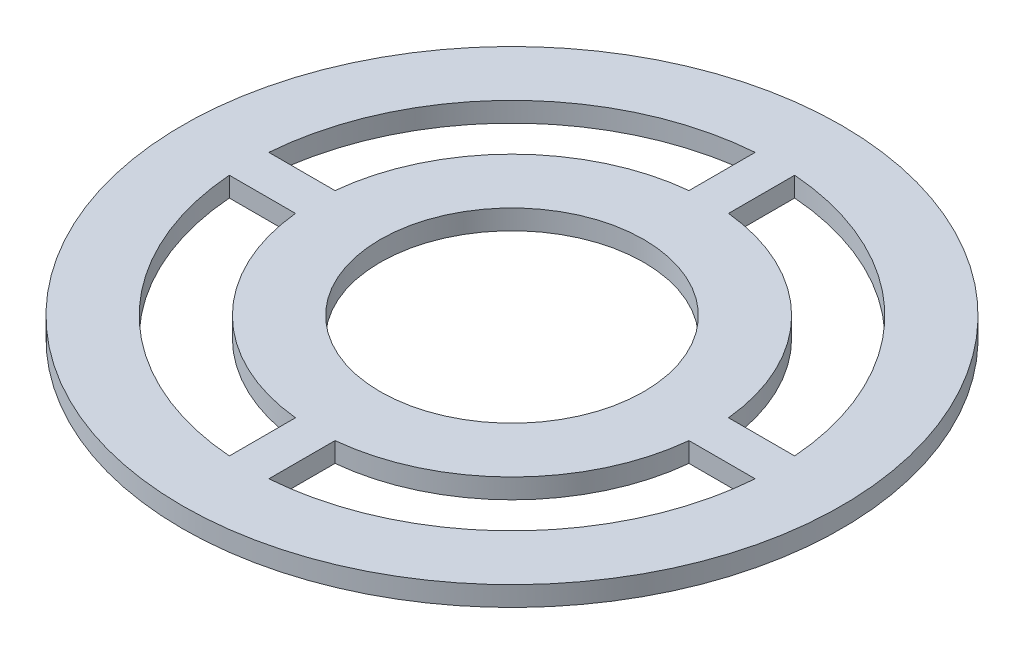
ISO-10303-21;
HEADER;
FILE_DESCRIPTION(('STEP AP214'),'2;1');
FILE_NAME('part.step','',(''),(''),'','','');
FILE_SCHEMA(('AUTOMOTIVE_DESIGN { 1 0 10303 214 1 1 1 1 }'));
ENDSEC;
DATA;
#1=APPLICATION_CONTEXT('core data for automotive mechanical design processes');
#2=APPLICATION_PROTOCOL_DEFINITION('international standard','automotive_design',2000,#1);
#3=PRODUCT_CONTEXT('',#1,'mechanical');
#4=PRODUCT('Part','Part','',(#3));
#5=PRODUCT_RELATED_PRODUCT_CATEGORY('part','',(#4));
#6=PRODUCT_DEFINITION_FORMATION('','',#4);
#7=PRODUCT_DEFINITION_CONTEXT('part definition',#1,'design');
#8=PRODUCT_DEFINITION('design','',#6,#7);
#9=PRODUCT_DEFINITION_SHAPE('','',#8);
#10=(LENGTH_UNIT() NAMED_UNIT(*) SI_UNIT(.MILLI.,.METRE.));
#11=(NAMED_UNIT(*) PLANE_ANGLE_UNIT() SI_UNIT($,.RADIAN.));
#12=(NAMED_UNIT(*) SI_UNIT($,.STERADIAN.) SOLID_ANGLE_UNIT());
#13=UNCERTAINTY_MEASURE_WITH_UNIT(LENGTH_MEASURE(1.E-05),#10,'distance_accuracy_value','');
#14=(GEOMETRIC_REPRESENTATION_CONTEXT(3) GLOBAL_UNCERTAINTY_ASSIGNED_CONTEXT((#13)) GLOBAL_UNIT_ASSIGNED_CONTEXT((#10,
#11,#12)) REPRESENTATION_CONTEXT('',''));
#15=CARTESIAN_POINT('',(0.,0.,0.));
#16=DIRECTION('',(0.,0.,1.));
#17=DIRECTION('',(1.,0.,0.));
#18=AXIS2_PLACEMENT_3D('',#15,#16,#17);
#19=CARTESIAN_POINT('',(0.,1.5,0.));
#20=DIRECTION('',(0.,-1.,0.));
#21=DIRECTION('',(0.,0.,-1.));
#22=AXIS2_PLACEMENT_3D('',#19,#20,#21);
#23=CYLINDRICAL_SURFACE('',#22,20.);
#24=DIRECTION('',(0.,-1.,0.));
#25=VECTOR('',#24,1.);
#26=CARTESIAN_POINT('',(-1.5,1.5,19.9436706751791));
#27=LINE('',#26,#25);
#28=CARTESIAN_POINT('',(-1.5,0.,19.9436706751791));
#29=VERTEX_POINT('',#28);
#30=CARTESIAN_POINT('',(-1.5,1.5,19.9436706751791));
#31=VERTEX_POINT('',#30);
#32=EDGE_CURVE('E158',#29,#31,#27,.F.);
#33=ORIENTED_EDGE('',*,*,#32,.F.);
#34=CARTESIAN_POINT('',(0.,0.,0.));
#35=DIRECTION('',(0.,1.,0.));
#36=DIRECTION('',(0.,0.,1.));
#37=AXIS2_PLACEMENT_3D('',#34,#35,#36);
#38=CIRCLE('',#37,20.);
#39=CARTESIAN_POINT('',(-19.9436706751791,0.,1.5));
#40=VERTEX_POINT('',#39);
#41=EDGE_CURVE('E241',#40,#29,#38,.T.);
#42=ORIENTED_EDGE('',*,*,#41,.F.);
#43=DIRECTION('',(0.,-1.,0.));
#44=VECTOR('',#43,1.);
#45=CARTESIAN_POINT('',(-19.9436706751791,1.5,1.5));
#46=LINE('',#45,#44);
#47=CARTESIAN_POINT('',(-19.9436706751791,1.5,1.5));
#48=VERTEX_POINT('',#47);
#49=EDGE_CURVE('E258',#48,#40,#46,.T.);
#50=ORIENTED_EDGE('',*,*,#49,.F.);
#51=CARTESIAN_POINT('',(0.,1.5,0.));
#52=DIRECTION('',(0.,1.,0.));
#53=DIRECTION('',(0.,0.,1.));
#54=AXIS2_PLACEMENT_3D('',#51,#52,#53);
#55=CIRCLE('',#54,20.);
#56=EDGE_CURVE('E56',#48,#31,#55,.T.);
#57=ORIENTED_EDGE('',*,*,#56,.T.);
#58=EDGE_LOOP('',(#33,#42,#50,#57));
#59=FACE_BOUND('',#58,.T.);
#60=ADVANCED_FACE('F41',(#59),#23,.F.);
#61=CARTESIAN_POINT('',(0.,1.5,0.));
#62=DIRECTION('',(0.,-1.,0.));
#63=DIRECTION('',(0.,0.,-1.));
#64=AXIS2_PLACEMENT_3D('',#61,#62,#63);
#65=CYLINDRICAL_SURFACE('',#64,15.);
#66=CARTESIAN_POINT('',(0.,0.,0.));
#67=DIRECTION('',(0.,1.,0.));
#68=DIRECTION('',(0.,0.,1.));
#69=AXIS2_PLACEMENT_3D('',#66,#67,#68);
#70=CIRCLE('',#69,15.);
#71=CARTESIAN_POINT('',(-14.9248115565993,0.,1.5));
#72=VERTEX_POINT('',#71);
#73=CARTESIAN_POINT('',(-1.5,0.,14.9248115565993));
#74=VERTEX_POINT('',#73);
#75=EDGE_CURVE('E169',#72,#74,#70,.T.);
#76=ORIENTED_EDGE('',*,*,#75,.T.);
#77=DIRECTION('',(0.,-1.,0.));
#78=VECTOR('',#77,1.);
#79=CARTESIAN_POINT('',(-1.5,1.5,14.9248115565993));
#80=LINE('',#79,#78);
#81=CARTESIAN_POINT('',(-1.5,1.5,14.9248115565993));
#82=VERTEX_POINT('',#81);
#83=EDGE_CURVE('E12',#74,#82,#80,.F.);
#84=ORIENTED_EDGE('',*,*,#83,.T.);
#85=CARTESIAN_POINT('',(0.,1.5,0.));
#86=DIRECTION('',(0.,1.,0.));
#87=DIRECTION('',(0.,0.,1.));
#88=AXIS2_PLACEMENT_3D('',#85,#86,#87);
#89=CIRCLE('',#88,15.);
#90=CARTESIAN_POINT('',(-14.9248115565993,1.5,1.5));
#91=VERTEX_POINT('',#90);
#92=EDGE_CURVE('E166',#91,#82,#89,.T.);
#93=ORIENTED_EDGE('',*,*,#92,.F.);
#94=DIRECTION('',(0.,1.,0.));
#95=VECTOR('',#94,1.);
#96=CARTESIAN_POINT('',(-14.9248115565993,0.,1.5));
#97=LINE('',#96,#95);
#98=EDGE_CURVE('E303',#72,#91,#97,.T.);
#99=ORIENTED_EDGE('',*,*,#98,.F.);
#100=EDGE_LOOP('',(#76,#84,#93,#99));
#101=FACE_BOUND('',#100,.T.);
#102=ADVANCED_FACE('F165',(#101),#65,.T.);
#103=DIRECTION('',(0.,-1.,0.));
#104=VECTOR('',#103,1.);
#105=CARTESIAN_POINT('',(19.9436706751791,1.5,-1.5));
#106=LINE('',#105,#104);
#107=CARTESIAN_POINT('',(19.9436706751791,1.5,-1.5));
#108=VERTEX_POINT('',#107);
#109=CARTESIAN_POINT('',(19.9436706751791,0.,-1.5));
#110=VERTEX_POINT('',#109);
#111=EDGE_CURVE('E209',#108,#110,#106,.T.);
#112=ORIENTED_EDGE('',*,*,#111,.F.);
#113=CARTESIAN_POINT('',(1.5,1.5,-19.9436706751791));
#114=VERTEX_POINT('',#113);
#115=EDGE_CURVE('E338',#108,#114,#55,.T.);
#116=ORIENTED_EDGE('',*,*,#115,.T.);
#117=DIRECTION('',(0.,-1.,0.));
#118=VECTOR('',#117,1.);
#119=CARTESIAN_POINT('',(1.5,1.5,-19.9436706751791));
#120=LINE('',#119,#118);
#121=CARTESIAN_POINT('',(1.5,0.,-19.9436706751791));
#122=VERTEX_POINT('',#121);
#123=EDGE_CURVE('E199',#122,#114,#120,.F.);
#124=ORIENTED_EDGE('',*,*,#123,.F.);
#125=EDGE_CURVE('E250',#110,#122,#38,.T.);
#126=ORIENTED_EDGE('',*,*,#125,.F.);
#127=EDGE_LOOP('',(#112,#116,#124,#126));
#128=FACE_BOUND('',#127,.T.);
#129=ADVANCED_FACE('F309',(#128),#23,.F.);
#130=CARTESIAN_POINT('',(14.9248115565993,1.5,-1.5));
#131=VERTEX_POINT('',#130);
#132=CARTESIAN_POINT('',(1.5,1.5,-14.9248115565993));
#133=VERTEX_POINT('',#132);
#134=EDGE_CURVE('E180',#131,#133,#89,.T.);
#135=ORIENTED_EDGE('',*,*,#134,.F.);
#136=DIRECTION('',(0.,-1.,0.));
#137=VECTOR('',#136,1.);
#138=CARTESIAN_POINT('',(14.9248115565993,1.5,-1.5));
#139=LINE('',#138,#137);
#140=CARTESIAN_POINT('',(14.9248115565993,0.,-1.5));
#141=VERTEX_POINT('',#140);
#142=EDGE_CURVE('E285',#131,#141,#139,.T.);
#143=ORIENTED_EDGE('',*,*,#142,.T.);
#144=CARTESIAN_POINT('',(1.5,0.,-14.9248115565993));
#145=VERTEX_POINT('',#144);
#146=EDGE_CURVE('E299',#141,#145,#70,.T.);
#147=ORIENTED_EDGE('',*,*,#146,.T.);
#148=DIRECTION('',(0.,-1.,0.));
#149=VECTOR('',#148,1.);
#150=CARTESIAN_POINT('',(1.5,1.5,-14.9248115565993));
#151=LINE('',#150,#149);
#152=EDGE_CURVE('E270',#145,#133,#151,.F.);
#153=ORIENTED_EDGE('',*,*,#152,.T.);
#154=EDGE_LOOP('',(#135,#143,#147,#153));
#155=FACE_BOUND('',#154,.T.);
#156=ADVANCED_FACE('F314',(#155),#65,.T.);
#157=DIRECTION('',(0.,-1.,0.));
#158=VECTOR('',#157,1.);
#159=CARTESIAN_POINT('',(-1.5,1.5,-19.9436706751791));
#160=LINE('',#159,#158);
#161=CARTESIAN_POINT('',(-1.5,1.5,-19.9436706751791));
#162=VERTEX_POINT('',#161);
#163=CARTESIAN_POINT('',(-1.5,0.,-19.9436706751791));
#164=VERTEX_POINT('',#163);
#165=EDGE_CURVE('E195',#162,#164,#160,.T.);
#166=ORIENTED_EDGE('',*,*,#165,.F.);
#167=CARTESIAN_POINT('',(-19.9436706751791,1.5,-1.5));
#168=VERTEX_POINT('',#167);
#169=EDGE_CURVE('E248',#162,#168,#55,.T.);
#170=ORIENTED_EDGE('',*,*,#169,.T.);
#171=DIRECTION('',(0.,-1.,0.));
#172=VECTOR('',#171,1.);
#173=CARTESIAN_POINT('',(-19.9436706751791,1.5,-1.5));
#174=LINE('',#173,#172);
#175=CARTESIAN_POINT('',(-19.9436706751791,0.,-1.5));
#176=VERTEX_POINT('',#175);
#177=EDGE_CURVE('E252',#176,#168,#174,.F.);
#178=ORIENTED_EDGE('',*,*,#177,.F.);
#179=EDGE_CURVE('E246',#164,#176,#38,.T.);
#180=ORIENTED_EDGE('',*,*,#179,.F.);
#181=EDGE_LOOP('',(#166,#170,#178,#180));
#182=FACE_BOUND('',#181,.T.);
#183=ADVANCED_FACE('F317',(#182),#23,.F.);
#184=CARTESIAN_POINT('',(-1.5,1.5,-14.9248115565993));
#185=VERTEX_POINT('',#184);
#186=CARTESIAN_POINT('',(-14.9248115565993,1.5,-1.5));
#187=VERTEX_POINT('',#186);
#188=EDGE_CURVE('E177',#185,#187,#89,.T.);
#189=ORIENTED_EDGE('',*,*,#188,.F.);
#190=DIRECTION('',(0.,-1.,0.));
#191=VECTOR('',#190,1.);
#192=CARTESIAN_POINT('',(-1.5,1.5,-14.9248115565993));
#193=LINE('',#192,#191);
#194=CARTESIAN_POINT('',(-1.5,0.,-14.9248115565993));
#195=VERTEX_POINT('',#194);
#196=EDGE_CURVE('E274',#185,#195,#193,.T.);
#197=ORIENTED_EDGE('',*,*,#196,.T.);
#198=CARTESIAN_POINT('',(-14.9248115565993,0.,-1.5));
#199=VERTEX_POINT('',#198);
#200=EDGE_CURVE('E193',#195,#199,#70,.T.);
#201=ORIENTED_EDGE('',*,*,#200,.T.);
#202=DIRECTION('',(0.,1.,0.));
#203=VECTOR('',#202,1.);
#204=CARTESIAN_POINT('',(-14.9248115565993,0.,-1.5));
#205=LINE('',#204,#203);
#206=EDGE_CURVE('E263',#199,#187,#205,.T.);
#207=ORIENTED_EDGE('',*,*,#206,.T.);
#208=EDGE_LOOP('',(#189,#197,#201,#207));
#209=FACE_BOUND('',#208,.T.);
#210=ADVANCED_FACE('F320',(#209),#65,.T.);
#211=DIRECTION('',(0.,-1.,0.));
#212=VECTOR('',#211,1.);
#213=CARTESIAN_POINT('',(1.5,1.5,19.9436706751791));
#214=LINE('',#213,#212);
#215=CARTESIAN_POINT('',(1.5,1.5,19.9436706751791));
#216=VERTEX_POINT('',#215);
#217=CARTESIAN_POINT('',(1.5,0.,19.9436706751791));
#218=VERTEX_POINT('',#217);
#219=EDGE_CURVE('E229',#216,#218,#214,.T.);
#220=ORIENTED_EDGE('',*,*,#219,.F.);
#221=CARTESIAN_POINT('',(19.9436706751791,1.5,1.5));
#222=VERTEX_POINT('',#221);
#223=EDGE_CURVE('E268',#216,#222,#55,.T.);
#224=ORIENTED_EDGE('',*,*,#223,.T.);
#225=DIRECTION('',(0.,-1.,0.));
#226=VECTOR('',#225,1.);
#227=CARTESIAN_POINT('',(19.9436706751791,1.5,1.5));
#228=LINE('',#227,#226);
#229=CARTESIAN_POINT('',(19.9436706751791,0.,1.5));
#230=VERTEX_POINT('',#229);
#231=EDGE_CURVE('E215',#230,#222,#228,.F.);
#232=ORIENTED_EDGE('',*,*,#231,.F.);
#233=EDGE_CURVE('E64',#218,#230,#38,.T.);
#234=ORIENTED_EDGE('',*,*,#233,.F.);
#235=EDGE_LOOP('',(#220,#224,#232,#234));
#236=FACE_BOUND('',#235,.T.);
#237=ADVANCED_FACE('F43',(#236),#23,.F.);
#238=CARTESIAN_POINT('',(0.,1.5,0.));
#239=DIRECTION('',(0.,-1.,0.));
#240=DIRECTION('',(0.,0.,-1.));
#241=AXIS2_PLACEMENT_3D('',#238,#239,#240);
#242=CYLINDRICAL_SURFACE('',#241,25.);
#243=CARTESIAN_POINT('',(0.,1.5,0.));
#244=DIRECTION('',(0.,1.,0.));
#245=DIRECTION('',(0.,0.,1.));
#246=AXIS2_PLACEMENT_3D('',#243,#244,#245);
#247=CIRCLE('',#246,25.);
#248=CARTESIAN_POINT('',(0.,1.5,25.));
#249=VERTEX_POINT('',#248);
#250=EDGE_CURVE('E267',#249,#249,#247,.T.);
#251=ORIENTED_EDGE('',*,*,#250,.F.);
#252=EDGE_LOOP('',(#251));
#253=FACE_BOUND('',#252,.T.);
#254=CARTESIAN_POINT('',(0.,0.,0.));
#255=DIRECTION('',(0.,1.,0.));
#256=DIRECTION('',(0.,0.,1.));
#257=AXIS2_PLACEMENT_3D('',#254,#255,#256);
#258=CIRCLE('',#257,25.);
#259=CARTESIAN_POINT('',(0.,0.,25.));
#260=VERTEX_POINT('',#259);
#261=EDGE_CURVE('E244',#260,#260,#258,.T.);
#262=ORIENTED_EDGE('',*,*,#261,.T.);
#263=EDGE_LOOP('',(#262));
#264=FACE_BOUND('',#263,.T.);
#265=ADVANCED_FACE('F319',(#253,#264),#242,.T.);
#266=CARTESIAN_POINT('',(-55.1414213562373,1.5,0.));
#267=DIRECTION('',(0.,1.,0.));
#268=DIRECTION('',(0.,0.,1.));
#269=AXIS2_PLACEMENT_3D('',#266,#267,#268);
#270=PLANE('',#269);
#271=ORIENTED_EDGE('',*,*,#223,.F.);
#272=DIRECTION('',(0.,0.,-1.));
#273=VECTOR('',#272,1.);
#274=CARTESIAN_POINT('',(1.5,1.5,14.));
#275=LINE('',#274,#273);
#276=CARTESIAN_POINT('',(1.5,1.5,14.9248115565993));
#277=VERTEX_POINT('',#276);
#278=EDGE_CURVE('E161',#216,#277,#275,.T.);
#279=ORIENTED_EDGE('',*,*,#278,.T.);
#280=CARTESIAN_POINT('',(14.9248115565993,1.5,1.5));
#281=VERTEX_POINT('',#280);
#282=EDGE_CURVE('E175',#277,#281,#89,.T.);
#283=ORIENTED_EDGE('',*,*,#282,.T.);
#284=DIRECTION('',(1.,0.,0.));
#285=VECTOR('',#284,1.);
#286=CARTESIAN_POINT('',(14.,1.5,1.5));
#287=LINE('',#286,#285);
#288=EDGE_CURVE('E222',#281,#222,#287,.T.);
#289=ORIENTED_EDGE('',*,*,#288,.T.);
#290=EDGE_LOOP('',(#271,#279,#283,#289));
#291=FACE_BOUND('',#290,.T.);
#292=ORIENTED_EDGE('',*,*,#92,.T.);
#293=DIRECTION('',(0.,0.,1.));
#294=VECTOR('',#293,1.);
#295=CARTESIAN_POINT('',(-1.5,1.5,14.));
#296=LINE('',#295,#294);
#297=EDGE_CURVE('E154',#82,#31,#296,.T.);
#298=ORIENTED_EDGE('',*,*,#297,.T.);
#299=ORIENTED_EDGE('',*,*,#56,.F.);
#300=DIRECTION('',(1.,0.,0.));
#301=VECTOR('',#300,1.);
#302=CARTESIAN_POINT('',(-21.9248115565993,1.5,1.5));
#303=LINE('',#302,#301);
#304=EDGE_CURVE('E173',#48,#91,#303,.T.);
#305=ORIENTED_EDGE('',*,*,#304,.T.);
#306=EDGE_LOOP('',(#292,#298,#299,#305));
#307=FACE_BOUND('',#306,.T.);
#308=ORIENTED_EDGE('',*,*,#115,.F.);
#309=DIRECTION('',(-1.,0.,0.));
#310=VECTOR('',#309,1.);
#311=CARTESIAN_POINT('',(14.,1.5,-1.5));
#312=LINE('',#311,#310);
#313=EDGE_CURVE('E219',#108,#131,#312,.T.);
#314=ORIENTED_EDGE('',*,*,#313,.T.);
#315=ORIENTED_EDGE('',*,*,#134,.T.);
#316=DIRECTION('',(0.,0.,-1.));
#317=VECTOR('',#316,1.);
#318=CARTESIAN_POINT('',(1.5,1.5,-21.));
#319=LINE('',#318,#317);
#320=EDGE_CURVE('E203',#133,#114,#319,.T.);
#321=ORIENTED_EDGE('',*,*,#320,.T.);
#322=EDGE_LOOP('',(#308,#314,#315,#321));
#323=FACE_BOUND('',#322,.T.);
#324=ORIENTED_EDGE('',*,*,#169,.F.);
#325=DIRECTION('',(0.,0.,1.));
#326=VECTOR('',#325,1.);
#327=CARTESIAN_POINT('',(-1.5,1.5,-21.));
#328=LINE('',#327,#326);
#329=EDGE_CURVE('E207',#162,#185,#328,.T.);
#330=ORIENTED_EDGE('',*,*,#329,.T.);
#331=ORIENTED_EDGE('',*,*,#188,.T.);
#332=DIRECTION('',(-1.,0.,0.));
#333=VECTOR('',#332,1.);
#334=CARTESIAN_POINT('',(-21.9248115565993,1.5,-1.5));
#335=LINE('',#334,#333);
#336=EDGE_CURVE('E178',#187,#168,#335,.T.);
#337=ORIENTED_EDGE('',*,*,#336,.T.);
#338=EDGE_LOOP('',(#324,#330,#331,#337));
#339=FACE_BOUND('',#338,.T.);
#340=CARTESIAN_POINT('',(0.,1.5,0.));
#341=DIRECTION('',(0.,1.,0.));
#342=DIRECTION('',(0.,0.,1.));
#343=AXIS2_PLACEMENT_3D('',#340,#341,#342);
#344=CIRCLE('',#343,10.);
#345=CARTESIAN_POINT('',(0.,1.5,10.));
#346=VERTEX_POINT('',#345);
#347=EDGE_CURVE('E183',#346,#346,#344,.T.);
#348=ORIENTED_EDGE('',*,*,#347,.F.);
#349=EDGE_LOOP('',(#348));
#350=FACE_BOUND('',#349,.T.);
#351=ORIENTED_EDGE('',*,*,#250,.T.);
#352=EDGE_LOOP('',(#351));
#353=FACE_BOUND('',#352,.T.);
#354=ADVANCED_FACE('F170',(#291,#307,#323,#339,#350,#353),#270,.T.);
#355=CARTESIAN_POINT('',(-55.1414213562373,0.,0.));
#356=DIRECTION('',(0.,1.,0.));
#357=DIRECTION('',(0.,0.,1.));
#358=AXIS2_PLACEMENT_3D('',#355,#356,#357);
#359=PLANE('',#358);
#360=DIRECTION('',(0.,0.,-1.));
#361=VECTOR('',#360,1.);
#362=CARTESIAN_POINT('',(1.5,0.,14.));
#363=LINE('',#362,#361);
#364=CARTESIAN_POINT('',(1.5,0.,14.9248115565993));
#365=VERTEX_POINT('',#364);
#366=EDGE_CURVE('E231',#218,#365,#363,.T.);
#367=ORIENTED_EDGE('',*,*,#366,.F.);
#368=ORIENTED_EDGE('',*,*,#233,.T.);
#369=DIRECTION('',(1.,0.,0.));
#370=VECTOR('',#369,1.);
#371=CARTESIAN_POINT('',(14.,0.,1.5));
#372=LINE('',#371,#370);
#373=CARTESIAN_POINT('',(14.9248115565993,0.,1.5));
#374=VERTEX_POINT('',#373);
#375=EDGE_CURVE('E221',#374,#230,#372,.T.);
#376=ORIENTED_EDGE('',*,*,#375,.F.);
#377=EDGE_CURVE('E191',#365,#374,#70,.T.);
#378=ORIENTED_EDGE('',*,*,#377,.F.);
#379=EDGE_LOOP('',(#367,#368,#376,#378));
#380=FACE_BOUND('',#379,.T.);
#381=DIRECTION('',(0.,0.,1.));
#382=VECTOR('',#381,1.);
#383=CARTESIAN_POINT('',(-1.5,0.,14.));
#384=LINE('',#383,#382);
#385=EDGE_CURVE('E232',#74,#29,#384,.T.);
#386=ORIENTED_EDGE('',*,*,#385,.F.);
#387=ORIENTED_EDGE('',*,*,#75,.F.);
#388=DIRECTION('',(1.,0.,0.));
#389=VECTOR('',#388,1.);
#390=CARTESIAN_POINT('',(-21.9248115565993,0.,1.5));
#391=LINE('',#390,#389);
#392=EDGE_CURVE('E242',#40,#72,#391,.T.);
#393=ORIENTED_EDGE('',*,*,#392,.F.);
#394=ORIENTED_EDGE('',*,*,#41,.T.);
#395=EDGE_LOOP('',(#386,#387,#393,#394));
#396=FACE_BOUND('',#395,.T.);
#397=DIRECTION('',(-1.,0.,0.));
#398=VECTOR('',#397,1.);
#399=CARTESIAN_POINT('',(14.,0.,-1.5));
#400=LINE('',#399,#398);
#401=EDGE_CURVE('E218',#110,#141,#400,.T.);
#402=ORIENTED_EDGE('',*,*,#401,.F.);
#403=ORIENTED_EDGE('',*,*,#125,.T.);
#404=DIRECTION('',(0.,0.,-1.));
#405=VECTOR('',#404,1.);
#406=CARTESIAN_POINT('',(1.5,0.,-21.));
#407=LINE('',#406,#405);
#408=EDGE_CURVE('E202',#145,#122,#407,.T.);
#409=ORIENTED_EDGE('',*,*,#408,.F.);
#410=ORIENTED_EDGE('',*,*,#146,.F.);
#411=EDGE_LOOP('',(#402,#403,#409,#410));
#412=FACE_BOUND('',#411,.T.);
#413=DIRECTION('',(0.,0.,1.));
#414=VECTOR('',#413,1.);
#415=CARTESIAN_POINT('',(-1.5,0.,-21.));
#416=LINE('',#415,#414);
#417=EDGE_CURVE('E206',#164,#195,#416,.T.);
#418=ORIENTED_EDGE('',*,*,#417,.F.);
#419=ORIENTED_EDGE('',*,*,#179,.T.);
#420=DIRECTION('',(-1.,0.,0.));
#421=VECTOR('',#420,1.);
#422=CARTESIAN_POINT('',(-21.9248115565993,0.,-1.5));
#423=LINE('',#422,#421);
#424=EDGE_CURVE('E302',#199,#176,#423,.T.);
#425=ORIENTED_EDGE('',*,*,#424,.F.);
#426=ORIENTED_EDGE('',*,*,#200,.F.);
#427=EDGE_LOOP('',(#418,#419,#425,#426));
#428=FACE_BOUND('',#427,.T.);
#429=CARTESIAN_POINT('',(0.,0.,0.));
#430=DIRECTION('',(0.,1.,0.));
#431=DIRECTION('',(0.,0.,1.));
#432=AXIS2_PLACEMENT_3D('',#429,#430,#431);
#433=CIRCLE('',#432,10.);
#434=CARTESIAN_POINT('',(0.,0.,10.));
#435=VERTEX_POINT('',#434);
#436=EDGE_CURVE('E198',#435,#435,#433,.T.);
#437=ORIENTED_EDGE('',*,*,#436,.T.);
#438=EDGE_LOOP('',(#437));
#439=FACE_BOUND('',#438,.T.);
#440=ORIENTED_EDGE('',*,*,#261,.F.);
#441=EDGE_LOOP('',(#440));
#442=FACE_BOUND('',#441,.T.);
#443=ADVANCED_FACE('F237',(#380,#396,#412,#428,#439,#442),#359,.F.);
#444=CARTESIAN_POINT('',(-21.9248115565993,0.,-1.5));
#445=DIRECTION('',(0.,0.,-1.));
#446=DIRECTION('',(-1.,0.,0.));
#447=AXIS2_PLACEMENT_3D('',#444,#445,#446);
#448=PLANE('',#447);
#449=ORIENTED_EDGE('',*,*,#424,.T.);
#450=ORIENTED_EDGE('',*,*,#177,.T.);
#451=ORIENTED_EDGE('',*,*,#336,.F.);
#452=ORIENTED_EDGE('',*,*,#206,.F.);
#453=EDGE_LOOP('',(#449,#450,#451,#452));
#454=FACE_BOUND('',#453,.T.);
#455=ADVANCED_FACE('F369',(#454),#448,.T.);
#456=CARTESIAN_POINT('',(-21.9248115565993,0.,1.5));
#457=DIRECTION('',(0.,0.,1.));
#458=DIRECTION('',(1.,0.,0.));
#459=AXIS2_PLACEMENT_3D('',#456,#457,#458);
#460=PLANE('',#459);
#461=ORIENTED_EDGE('',*,*,#304,.F.);
#462=ORIENTED_EDGE('',*,*,#49,.T.);
#463=ORIENTED_EDGE('',*,*,#392,.T.);
#464=ORIENTED_EDGE('',*,*,#98,.T.);
#465=EDGE_LOOP('',(#461,#462,#463,#464));
#466=FACE_BOUND('',#465,.T.);
#467=ADVANCED_FACE('F307',(#466),#460,.T.);
#468=CARTESIAN_POINT('',(0.,1.5,0.));
#469=DIRECTION('',(0.,-1.,0.));
#470=DIRECTION('',(0.,0.,-1.));
#471=AXIS2_PLACEMENT_3D('',#468,#469,#470);
#472=CYLINDRICAL_SURFACE('',#471,10.);
#473=ORIENTED_EDGE('',*,*,#347,.T.);
#474=EDGE_LOOP('',(#473));
#475=FACE_BOUND('',#474,.T.);
#476=ORIENTED_EDGE('',*,*,#436,.F.);
#477=EDGE_LOOP('',(#476));
#478=FACE_BOUND('',#477,.T.);
#479=ADVANCED_FACE('F366',(#475,#478),#472,.F.);
#480=ORIENTED_EDGE('',*,*,#282,.F.);
#481=DIRECTION('',(0.,-1.,0.));
#482=VECTOR('',#481,1.);
#483=CARTESIAN_POINT('',(1.5,1.5,14.9248115565993));
#484=LINE('',#483,#482);
#485=EDGE_CURVE('E49',#277,#365,#484,.T.);
#486=ORIENTED_EDGE('',*,*,#485,.T.);
#487=ORIENTED_EDGE('',*,*,#377,.T.);
#488=DIRECTION('',(0.,-1.,0.));
#489=VECTOR('',#488,1.);
#490=CARTESIAN_POINT('',(14.9248115565993,1.5,1.5));
#491=LINE('',#490,#489);
#492=EDGE_CURVE('E280',#374,#281,#491,.F.);
#493=ORIENTED_EDGE('',*,*,#492,.T.);
#494=EDGE_LOOP('',(#480,#486,#487,#493));
#495=FACE_BOUND('',#494,.T.);
#496=ADVANCED_FACE('F292',(#495),#65,.T.);
#497=CARTESIAN_POINT('',(-1.5,0.,-21.));
#498=DIRECTION('',(-1.,0.,0.));
#499=DIRECTION('',(0.,0.,1.));
#500=AXIS2_PLACEMENT_3D('',#497,#498,#499);
#501=PLANE('',#500);
#502=ORIENTED_EDGE('',*,*,#329,.F.);
#503=ORIENTED_EDGE('',*,*,#165,.T.);
#504=ORIENTED_EDGE('',*,*,#417,.T.);
#505=ORIENTED_EDGE('',*,*,#196,.F.);
#506=EDGE_LOOP('',(#502,#503,#504,#505));
#507=FACE_BOUND('',#506,.T.);
#508=ADVANCED_FACE('F336',(#507),#501,.T.);
#509=CARTESIAN_POINT('',(1.5,0.,-21.));
#510=DIRECTION('',(1.,0.,0.));
#511=DIRECTION('',(0.,0.,-1.));
#512=AXIS2_PLACEMENT_3D('',#509,#510,#511);
#513=PLANE('',#512);
#514=ORIENTED_EDGE('',*,*,#408,.T.);
#515=ORIENTED_EDGE('',*,*,#123,.T.);
#516=ORIENTED_EDGE('',*,*,#320,.F.);
#517=ORIENTED_EDGE('',*,*,#152,.F.);
#518=EDGE_LOOP('',(#514,#515,#516,#517));
#519=FACE_BOUND('',#518,.T.);
#520=ADVANCED_FACE('F356',(#519),#513,.T.);
#521=CARTESIAN_POINT('',(14.,0.,-1.5));
#522=DIRECTION('',(0.,0.,-1.));
#523=DIRECTION('',(-1.,0.,0.));
#524=AXIS2_PLACEMENT_3D('',#521,#522,#523);
#525=PLANE('',#524);
#526=ORIENTED_EDGE('',*,*,#313,.F.);
#527=ORIENTED_EDGE('',*,*,#111,.T.);
#528=ORIENTED_EDGE('',*,*,#401,.T.);
#529=ORIENTED_EDGE('',*,*,#142,.F.);
#530=EDGE_LOOP('',(#526,#527,#528,#529));
#531=FACE_BOUND('',#530,.T.);
#532=ADVANCED_FACE('F353',(#531),#525,.T.);
#533=CARTESIAN_POINT('',(14.,0.,1.5));
#534=DIRECTION('',(0.,0.,1.));
#535=DIRECTION('',(1.,0.,0.));
#536=AXIS2_PLACEMENT_3D('',#533,#534,#535);
#537=PLANE('',#536);
#538=ORIENTED_EDGE('',*,*,#375,.T.);
#539=ORIENTED_EDGE('',*,*,#231,.T.);
#540=ORIENTED_EDGE('',*,*,#288,.F.);
#541=ORIENTED_EDGE('',*,*,#492,.F.);
#542=EDGE_LOOP('',(#538,#539,#540,#541));
#543=FACE_BOUND('',#542,.T.);
#544=ADVANCED_FACE('F344',(#543),#537,.T.);
#545=CARTESIAN_POINT('',(-1.5,0.,14.));
#546=DIRECTION('',(-1.,0.,0.));
#547=DIRECTION('',(0.,0.,1.));
#548=AXIS2_PLACEMENT_3D('',#545,#546,#547);
#549=PLANE('',#548);
#550=ORIENTED_EDGE('',*,*,#385,.T.);
#551=ORIENTED_EDGE('',*,*,#32,.T.);
#552=ORIENTED_EDGE('',*,*,#297,.F.);
#553=ORIENTED_EDGE('',*,*,#83,.F.);
#554=EDGE_LOOP('',(#550,#551,#552,#553));
#555=FACE_BOUND('',#554,.T.);
#556=ADVANCED_FACE('F156',(#555),#549,.T.);
#557=CARTESIAN_POINT('',(1.5,0.,14.));
#558=DIRECTION('',(1.,0.,0.));
#559=DIRECTION('',(0.,0.,-1.));
#560=AXIS2_PLACEMENT_3D('',#557,#558,#559);
#561=PLANE('',#560);
#562=ORIENTED_EDGE('',*,*,#278,.F.);
#563=ORIENTED_EDGE('',*,*,#219,.T.);
#564=ORIENTED_EDGE('',*,*,#366,.T.);
#565=ORIENTED_EDGE('',*,*,#485,.F.);
#566=EDGE_LOOP('',(#562,#563,#564,#565));
#567=FACE_BOUND('',#566,.T.);
#568=ADVANCED_FACE('F345',(#567),#561,.T.);
#569=CLOSED_SHELL('',(#60,#102,#129,#156,#183,#210,#237,#265,#354,#443,#455,#467,#479,#496,#508,
#520,#532,#544,#556,#568));
#570=MANIFOLD_SOLID_BREP('B2',#569);
#571=ADVANCED_BREP_SHAPE_REPRESENTATION('',(#18,#570),#14);
#572=SHAPE_DEFINITION_REPRESENTATION(#9,#571);
ENDSEC;
END-ISO-10303-21;
